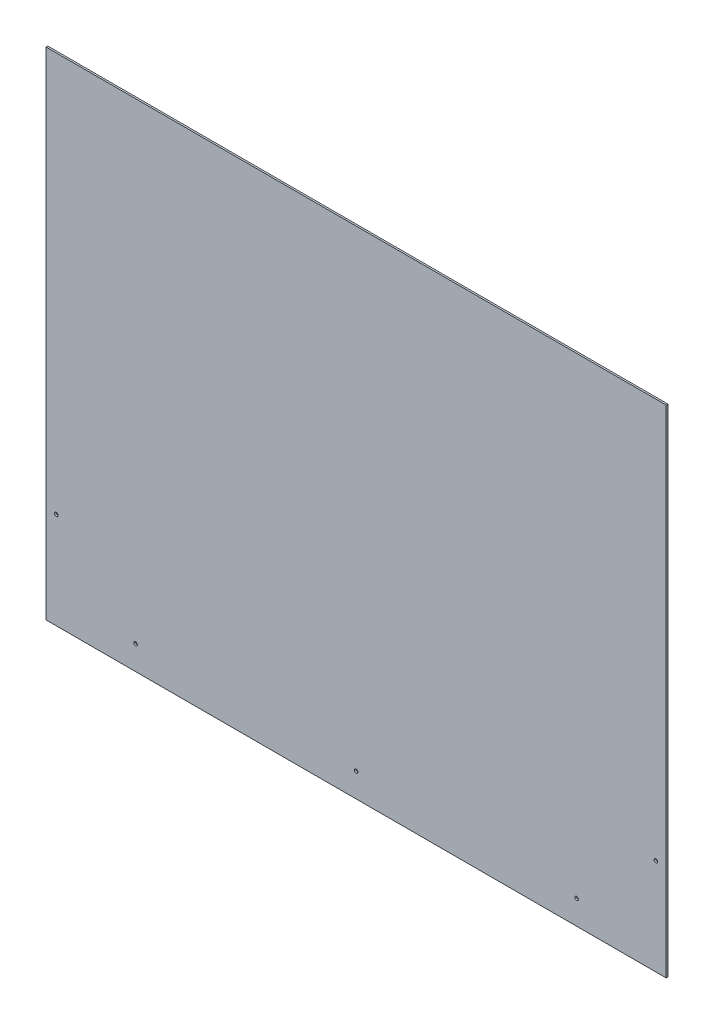
ISO-10303-21;
HEADER;
FILE_DESCRIPTION(('STEP AP214'),'2;1');
FILE_NAME('part.step','',(''),(''),'','','');
FILE_SCHEMA(('AUTOMOTIVE_DESIGN { 1 0 10303 214 1 1 1 1 }'));
ENDSEC;
DATA;
#1=APPLICATION_CONTEXT('core data for automotive mechanical design processes');
#2=APPLICATION_PROTOCOL_DEFINITION('international standard','automotive_design',2000,#1);
#3=PRODUCT_CONTEXT('',#1,'mechanical');
#4=PRODUCT('Part','Part','',(#3));
#5=PRODUCT_RELATED_PRODUCT_CATEGORY('part','',(#4));
#6=PRODUCT_DEFINITION_FORMATION('','',#4);
#7=PRODUCT_DEFINITION_CONTEXT('part definition',#1,'design');
#8=PRODUCT_DEFINITION('design','',#6,#7);
#9=PRODUCT_DEFINITION_SHAPE('','',#8);
#10=(LENGTH_UNIT() NAMED_UNIT(*) SI_UNIT(.MILLI.,.METRE.));
#11=(NAMED_UNIT(*) PLANE_ANGLE_UNIT() SI_UNIT($,.RADIAN.));
#12=(NAMED_UNIT(*) SI_UNIT($,.STERADIAN.) SOLID_ANGLE_UNIT());
#13=UNCERTAINTY_MEASURE_WITH_UNIT(LENGTH_MEASURE(1.E-05),#10,'distance_accuracy_value','');
#14=(GEOMETRIC_REPRESENTATION_CONTEXT(3) GLOBAL_UNCERTAINTY_ASSIGNED_CONTEXT((#13)) GLOBAL_UNIT_ASSIGNED_CONTEXT((#10,
#11,#12)) REPRESENTATION_CONTEXT('',''));
#15=CARTESIAN_POINT('',(0.,0.,0.));
#16=DIRECTION('',(0.,0.,1.));
#17=DIRECTION('',(1.,0.,0.));
#18=AXIS2_PLACEMENT_3D('',#15,#16,#17);
#19=CARTESIAN_POINT('',(0.,0.,1.5875));
#20=DIRECTION('',(0.,0.,1.));
#21=DIRECTION('',(1.,0.,0.));
#22=AXIS2_PLACEMENT_3D('',#19,#20,#21);
#23=PLANE('',#22);
#24=CARTESIAN_POINT('',(406.4,-412.75,1.5875));
#25=DIRECTION('',(0.,0.,1.));
#26=DIRECTION('',(1.,0.,0.));
#27=AXIS2_PLACEMENT_3D('',#24,#25,#26);
#28=CIRCLE('',#27,3.302);
#29=CARTESIAN_POINT('',(409.702,-412.75,1.5875));
#30=VERTEX_POINT('',#29);
#31=EDGE_CURVE('E95',#30,#30,#28,.F.);
#32=ORIENTED_EDGE('',*,*,#31,.T.);
#33=EDGE_LOOP('',(#32));
#34=FACE_BOUND('',#33,.T.);
#35=CARTESIAN_POINT('',(552.45,-279.4,1.5875));
#36=DIRECTION('',(0.,0.,1.));
#37=DIRECTION('',(1.,0.,0.));
#38=AXIS2_PLACEMENT_3D('',#35,#36,#37);
#39=CIRCLE('',#38,3.302);
#40=CARTESIAN_POINT('',(555.752,-279.4,1.5875));
#41=VERTEX_POINT('',#40);
#42=EDGE_CURVE('E98',#41,#41,#39,.F.);
#43=ORIENTED_EDGE('',*,*,#42,.T.);
#44=EDGE_LOOP('',(#43));
#45=FACE_BOUND('',#44,.T.);
#46=CARTESIAN_POINT('',(-406.4,-412.75,1.5875));
#47=DIRECTION('',(0.,0.,-1.));
#48=DIRECTION('',(-1.,0.,0.));
#49=AXIS2_PLACEMENT_3D('',#46,#47,#48);
#50=CIRCLE('',#49,3.302);
#51=CARTESIAN_POINT('',(-409.702,-412.75,1.5875));
#52=VERTEX_POINT('',#51);
#53=EDGE_CURVE('E101',#52,#52,#50,.T.);
#54=ORIENTED_EDGE('',*,*,#53,.T.);
#55=EDGE_LOOP('',(#54));
#56=FACE_BOUND('',#55,.T.);
#57=CARTESIAN_POINT('',(-552.45,-279.4,1.5875));
#58=DIRECTION('',(0.,0.,-1.));
#59=DIRECTION('',(-1.,0.,0.));
#60=AXIS2_PLACEMENT_3D('',#57,#58,#59);
#61=CIRCLE('',#60,3.302);
#62=CARTESIAN_POINT('',(-555.752,-279.4,1.5875));
#63=VERTEX_POINT('',#62);
#64=EDGE_CURVE('E103',#63,#63,#61,.T.);
#65=ORIENTED_EDGE('',*,*,#64,.T.);
#66=EDGE_LOOP('',(#65));
#67=FACE_BOUND('',#66,.T.);
#68=CARTESIAN_POINT('',(0.,-412.75,1.5875));
#69=DIRECTION('',(0.,0.,-1.));
#70=DIRECTION('',(-1.,0.,0.));
#71=AXIS2_PLACEMENT_3D('',#68,#69,#70);
#72=CIRCLE('',#71,3.302);
#73=CARTESIAN_POINT('',(-3.302,-412.75,1.5875));
#74=VERTEX_POINT('',#73);
#75=EDGE_CURVE('E20',#74,#74,#72,.T.);
#76=ORIENTED_EDGE('',*,*,#75,.T.);
#77=EDGE_LOOP('',(#76));
#78=FACE_BOUND('',#77,.T.);
#79=DIRECTION('',(1.,0.,0.));
#80=VECTOR('',#79,1.);
#81=CARTESIAN_POINT('',(571.5,457.2,1.5875));
#82=LINE('',#81,#80);
#83=CARTESIAN_POINT('',(-571.5,457.2,1.5875));
#84=VERTEX_POINT('',#83);
#85=CARTESIAN_POINT('',(571.5,457.2,1.5875));
#86=VERTEX_POINT('',#85);
#87=EDGE_CURVE('E71',#84,#86,#82,.T.);
#88=ORIENTED_EDGE('',*,*,#87,.F.);
#89=DIRECTION('',(0.,1.,0.));
#90=VECTOR('',#89,1.);
#91=CARTESIAN_POINT('',(-571.5,457.2,1.5875));
#92=LINE('',#91,#90);
#93=CARTESIAN_POINT('',(-571.5,-457.2,1.5875));
#94=VERTEX_POINT('',#93);
#95=EDGE_CURVE('E68',#94,#84,#92,.T.);
#96=ORIENTED_EDGE('',*,*,#95,.F.);
#97=DIRECTION('',(1.,0.,0.));
#98=VECTOR('',#97,1.);
#99=CARTESIAN_POINT('',(-571.5,-457.2,1.5875));
#100=LINE('',#99,#98);
#101=CARTESIAN_POINT('',(571.5,-457.2,1.5875));
#102=VERTEX_POINT('',#101);
#103=EDGE_CURVE('E59',#102,#94,#100,.F.);
#104=ORIENTED_EDGE('',*,*,#103,.F.);
#105=DIRECTION('',(0.,1.,0.));
#106=VECTOR('',#105,1.);
#107=CARTESIAN_POINT('',(571.5,-457.2,1.5875));
#108=LINE('',#107,#106);
#109=EDGE_CURVE('E54',#86,#102,#108,.F.);
#110=ORIENTED_EDGE('',*,*,#109,.F.);
#111=EDGE_LOOP('',(#88,#96,#104,#110));
#112=FACE_BOUND('',#111,.T.);
#113=ADVANCED_FACE('F17',(#34,#45,#56,#67,#78,#112),#23,.T.);
#114=CARTESIAN_POINT('',(-571.5,457.2,-1.5875));
#115=DIRECTION('',(-1.,0.,0.));
#116=DIRECTION('',(0.,0.,1.));
#117=AXIS2_PLACEMENT_3D('',#114,#115,#116);
#118=PLANE('',#117);
#119=DIRECTION('',(0.,0.,1.));
#120=VECTOR('',#119,1.);
#121=CARTESIAN_POINT('',(-571.5,457.2,-1.5875));
#122=LINE('',#121,#120);
#123=CARTESIAN_POINT('',(-571.5,457.2,-1.5875));
#124=VERTEX_POINT('',#123);
#125=EDGE_CURVE('E111',#124,#84,#122,.T.);
#126=ORIENTED_EDGE('',*,*,#125,.F.);
#127=DIRECTION('',(0.,1.,0.));
#128=VECTOR('',#127,1.);
#129=CARTESIAN_POINT('',(-571.5,0.,-1.5875));
#130=LINE('',#129,#128);
#131=CARTESIAN_POINT('',(-571.5,-457.2,-1.5875));
#132=VERTEX_POINT('',#131);
#133=EDGE_CURVE('E78',#124,#132,#130,.F.);
#134=ORIENTED_EDGE('',*,*,#133,.T.);
#135=DIRECTION('',(0.,0.,-1.));
#136=VECTOR('',#135,1.);
#137=CARTESIAN_POINT('',(-571.5,-457.2,-1.5875));
#138=LINE('',#137,#136);
#139=EDGE_CURVE('E64',#94,#132,#138,.T.);
#140=ORIENTED_EDGE('',*,*,#139,.F.);
#141=ORIENTED_EDGE('',*,*,#95,.T.);
#142=EDGE_LOOP('',(#126,#134,#140,#141));
#143=FACE_BOUND('',#142,.T.);
#144=ADVANCED_FACE('F77',(#143),#118,.T.);
#145=CARTESIAN_POINT('',(-571.5,-457.2,-1.5875));
#146=DIRECTION('',(0.,-1.,0.));
#147=DIRECTION('',(0.,0.,-1.));
#148=AXIS2_PLACEMENT_3D('',#145,#146,#147);
#149=PLANE('',#148);
#150=ORIENTED_EDGE('',*,*,#139,.T.);
#151=DIRECTION('',(1.,0.,0.));
#152=VECTOR('',#151,1.);
#153=CARTESIAN_POINT('',(0.,-457.2,-1.5875));
#154=LINE('',#153,#152);
#155=CARTESIAN_POINT('',(571.5,-457.2,-1.5875));
#156=VERTEX_POINT('',#155);
#157=EDGE_CURVE('E122',#132,#156,#154,.T.);
#158=ORIENTED_EDGE('',*,*,#157,.T.);
#159=DIRECTION('',(0.,0.,-1.));
#160=VECTOR('',#159,1.);
#161=CARTESIAN_POINT('',(571.5,-457.2,-1.5875));
#162=LINE('',#161,#160);
#163=EDGE_CURVE('E66',#102,#156,#162,.T.);
#164=ORIENTED_EDGE('',*,*,#163,.F.);
#165=ORIENTED_EDGE('',*,*,#103,.T.);
#166=EDGE_LOOP('',(#150,#158,#164,#165));
#167=FACE_BOUND('',#166,.T.);
#168=ADVANCED_FACE('F61',(#167),#149,.T.);
#169=CARTESIAN_POINT('',(571.5,-457.2,-1.5875));
#170=DIRECTION('',(1.,0.,0.));
#171=DIRECTION('',(0.,0.,-1.));
#172=AXIS2_PLACEMENT_3D('',#169,#170,#171);
#173=PLANE('',#172);
#174=ORIENTED_EDGE('',*,*,#163,.T.);
#175=DIRECTION('',(0.,1.,0.));
#176=VECTOR('',#175,1.);
#177=CARTESIAN_POINT('',(571.5,0.,-1.5875));
#178=LINE('',#177,#176);
#179=CARTESIAN_POINT('',(571.5,457.2,-1.5875));
#180=VERTEX_POINT('',#179);
#181=EDGE_CURVE('E119',#156,#180,#178,.T.);
#182=ORIENTED_EDGE('',*,*,#181,.T.);
#183=DIRECTION('',(0.,0.,1.));
#184=VECTOR('',#183,1.);
#185=CARTESIAN_POINT('',(571.5,457.2,-1.5875));
#186=LINE('',#185,#184);
#187=EDGE_CURVE('E35',#86,#180,#186,.F.);
#188=ORIENTED_EDGE('',*,*,#187,.F.);
#189=ORIENTED_EDGE('',*,*,#109,.T.);
#190=EDGE_LOOP('',(#174,#182,#188,#189));
#191=FACE_BOUND('',#190,.T.);
#192=ADVANCED_FACE('F118',(#191),#173,.T.);
#193=CARTESIAN_POINT('',(571.5,457.2,-1.5875));
#194=DIRECTION('',(0.,1.,0.));
#195=DIRECTION('',(0.,0.,1.));
#196=AXIS2_PLACEMENT_3D('',#193,#194,#195);
#197=PLANE('',#196);
#198=ORIENTED_EDGE('',*,*,#187,.T.);
#199=DIRECTION('',(1.,0.,0.));
#200=VECTOR('',#199,1.);
#201=CARTESIAN_POINT('',(0.,457.2,-1.5875));
#202=LINE('',#201,#200);
#203=EDGE_CURVE('E94',#180,#124,#202,.F.);
#204=ORIENTED_EDGE('',*,*,#203,.T.);
#205=ORIENTED_EDGE('',*,*,#125,.T.);
#206=ORIENTED_EDGE('',*,*,#87,.T.);
#207=EDGE_LOOP('',(#198,#204,#205,#206));
#208=FACE_BOUND('',#207,.T.);
#209=ADVANCED_FACE('F125',(#208),#197,.T.);
#210=CARTESIAN_POINT('',(0.,-412.75,1.5875));
#211=DIRECTION('',(0.,0.,-1.));
#212=DIRECTION('',(-1.,0.,0.));
#213=AXIS2_PLACEMENT_3D('',#210,#211,#212);
#214=CYLINDRICAL_SURFACE('',#213,3.302);
#215=ORIENTED_EDGE('',*,*,#75,.F.);
#216=EDGE_LOOP('',(#215));
#217=FACE_BOUND('',#216,.T.);
#218=CARTESIAN_POINT('',(0.,-412.75,-1.5875));
#219=DIRECTION('',(0.,0.,-1.));
#220=DIRECTION('',(-1.,0.,0.));
#221=AXIS2_PLACEMENT_3D('',#218,#219,#220);
#222=CIRCLE('',#221,3.302);
#223=CARTESIAN_POINT('',(-3.302,-412.75,-1.5875));
#224=VERTEX_POINT('',#223);
#225=EDGE_CURVE('E91',#224,#224,#222,.T.);
#226=ORIENTED_EDGE('',*,*,#225,.T.);
#227=EDGE_LOOP('',(#226));
#228=FACE_BOUND('',#227,.T.);
#229=ADVANCED_FACE('F127',(#217,#228),#214,.F.);
#230=CARTESIAN_POINT('',(-552.45,-279.4,1.5875));
#231=DIRECTION('',(0.,0.,-1.));
#232=DIRECTION('',(-1.,0.,0.));
#233=AXIS2_PLACEMENT_3D('',#230,#231,#232);
#234=CYLINDRICAL_SURFACE('',#233,3.302);
#235=ORIENTED_EDGE('',*,*,#64,.F.);
#236=EDGE_LOOP('',(#235));
#237=FACE_BOUND('',#236,.T.);
#238=CARTESIAN_POINT('',(-552.45,-279.4,-1.5875));
#239=DIRECTION('',(0.,0.,-1.));
#240=DIRECTION('',(-1.,0.,0.));
#241=AXIS2_PLACEMENT_3D('',#238,#239,#240);
#242=CIRCLE('',#241,3.302);
#243=CARTESIAN_POINT('',(-555.752,-279.4,-1.5875));
#244=VERTEX_POINT('',#243);
#245=EDGE_CURVE('E88',#244,#244,#242,.T.);
#246=ORIENTED_EDGE('',*,*,#245,.T.);
#247=EDGE_LOOP('',(#246));
#248=FACE_BOUND('',#247,.T.);
#249=ADVANCED_FACE('F134',(#237,#248),#234,.F.);
#250=CARTESIAN_POINT('',(-406.4,-412.75,1.5875));
#251=DIRECTION('',(0.,0.,-1.));
#252=DIRECTION('',(-1.,0.,0.));
#253=AXIS2_PLACEMENT_3D('',#250,#251,#252);
#254=CYLINDRICAL_SURFACE('',#253,3.302);
#255=ORIENTED_EDGE('',*,*,#53,.F.);
#256=EDGE_LOOP('',(#255));
#257=FACE_BOUND('',#256,.T.);
#258=CARTESIAN_POINT('',(-406.4,-412.75,-1.5875));
#259=DIRECTION('',(0.,0.,-1.));
#260=DIRECTION('',(-1.,0.,0.));
#261=AXIS2_PLACEMENT_3D('',#258,#259,#260);
#262=CIRCLE('',#261,3.302);
#263=CARTESIAN_POINT('',(-409.702,-412.75,-1.5875));
#264=VERTEX_POINT('',#263);
#265=EDGE_CURVE('E85',#264,#264,#262,.T.);
#266=ORIENTED_EDGE('',*,*,#265,.T.);
#267=EDGE_LOOP('',(#266));
#268=FACE_BOUND('',#267,.T.);
#269=ADVANCED_FACE('F153',(#257,#268),#254,.F.);
#270=CARTESIAN_POINT('',(552.45,-279.4,1.5875));
#271=DIRECTION('',(0.,0.,1.));
#272=DIRECTION('',(1.,0.,0.));
#273=AXIS2_PLACEMENT_3D('',#270,#271,#272);
#274=CYLINDRICAL_SURFACE('',#273,3.302);
#275=ORIENTED_EDGE('',*,*,#42,.F.);
#276=EDGE_LOOP('',(#275));
#277=FACE_BOUND('',#276,.T.);
#278=CARTESIAN_POINT('',(552.45,-279.4,-1.5875));
#279=DIRECTION('',(0.,0.,1.));
#280=DIRECTION('',(1.,0.,0.));
#281=AXIS2_PLACEMENT_3D('',#278,#279,#280);
#282=CIRCLE('',#281,3.302);
#283=CARTESIAN_POINT('',(555.752,-279.4,-1.5875));
#284=VERTEX_POINT('',#283);
#285=EDGE_CURVE('E26',#284,#284,#282,.F.);
#286=ORIENTED_EDGE('',*,*,#285,.T.);
#287=EDGE_LOOP('',(#286));
#288=FACE_BOUND('',#287,.T.);
#289=ADVANCED_FACE('F145',(#277,#288),#274,.F.);
#290=CARTESIAN_POINT('',(406.4,-412.75,1.5875));
#291=DIRECTION('',(0.,0.,1.));
#292=DIRECTION('',(1.,0.,0.));
#293=AXIS2_PLACEMENT_3D('',#290,#291,#292);
#294=CYLINDRICAL_SURFACE('',#293,3.302);
#295=ORIENTED_EDGE('',*,*,#31,.F.);
#296=EDGE_LOOP('',(#295));
#297=FACE_BOUND('',#296,.T.);
#298=CARTESIAN_POINT('',(406.4,-412.75,-1.5875));
#299=DIRECTION('',(0.,0.,1.));
#300=DIRECTION('',(1.,0.,0.));
#301=AXIS2_PLACEMENT_3D('',#298,#299,#300);
#302=CIRCLE('',#301,3.302);
#303=CARTESIAN_POINT('',(409.702,-412.75,-1.5875));
#304=VERTEX_POINT('',#303);
#305=EDGE_CURVE('E11',#304,#304,#302,.F.);
#306=ORIENTED_EDGE('',*,*,#305,.T.);
#307=EDGE_LOOP('',(#306));
#308=FACE_BOUND('',#307,.T.);
#309=ADVANCED_FACE('F139',(#297,#308),#294,.F.);
#310=CARTESIAN_POINT('',(0.,0.,-1.5875));
#311=DIRECTION('',(0.,0.,1.));
#312=DIRECTION('',(1.,0.,0.));
#313=AXIS2_PLACEMENT_3D('',#310,#311,#312);
#314=PLANE('',#313);
#315=ORIENTED_EDGE('',*,*,#305,.F.);
#316=EDGE_LOOP('',(#315));
#317=FACE_BOUND('',#316,.T.);
#318=ORIENTED_EDGE('',*,*,#285,.F.);
#319=EDGE_LOOP('',(#318));
#320=FACE_BOUND('',#319,.T.);
#321=ORIENTED_EDGE('',*,*,#265,.F.);
#322=EDGE_LOOP('',(#321));
#323=FACE_BOUND('',#322,.T.);
#324=ORIENTED_EDGE('',*,*,#245,.F.);
#325=EDGE_LOOP('',(#324));
#326=FACE_BOUND('',#325,.T.);
#327=ORIENTED_EDGE('',*,*,#225,.F.);
#328=EDGE_LOOP('',(#327));
#329=FACE_BOUND('',#328,.T.);
#330=ORIENTED_EDGE('',*,*,#181,.F.);
#331=ORIENTED_EDGE('',*,*,#157,.F.);
#332=ORIENTED_EDGE('',*,*,#133,.F.);
#333=ORIENTED_EDGE('',*,*,#203,.F.);
#334=EDGE_LOOP('',(#330,#331,#332,#333));
#335=FACE_BOUND('',#334,.T.);
#336=ADVANCED_FACE('F121',(#317,#320,#323,#326,#329,#335),#314,.F.);
#337=CLOSED_SHELL('',(#113,#144,#168,#192,#209,#229,#249,#269,#289,#309,#336));
#338=MANIFOLD_SOLID_BREP('B1',#337);
#339=ADVANCED_BREP_SHAPE_REPRESENTATION('',(#18,#338),#14);
#340=SHAPE_DEFINITION_REPRESENTATION(#9,#339);
ENDSEC;
END-ISO-10303-21;
